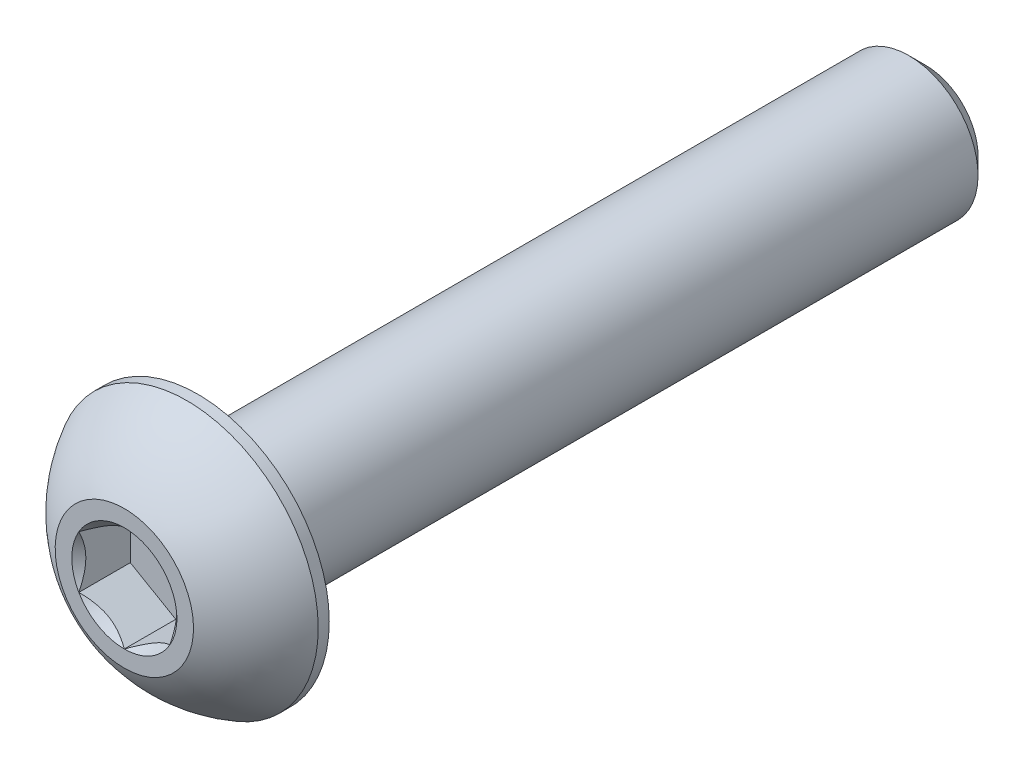
ISO-10303-21;
HEADER;
FILE_DESCRIPTION(('STEP AP214'),'2;1');
FILE_NAME('part.step','',(''),(''),'','','');
FILE_SCHEMA(('AUTOMOTIVE_DESIGN { 1 0 10303 214 1 1 1 1 }'));
ENDSEC;
DATA;
#1=APPLICATION_CONTEXT('core data for automotive mechanical design processes');
#2=APPLICATION_PROTOCOL_DEFINITION('international standard','automotive_design',2000,#1);
#3=PRODUCT_CONTEXT('',#1,'mechanical');
#4=PRODUCT('Part','Part','',(#3));
#5=PRODUCT_RELATED_PRODUCT_CATEGORY('part','',(#4));
#6=PRODUCT_DEFINITION_FORMATION('','',#4);
#7=PRODUCT_DEFINITION_CONTEXT('part definition',#1,'design');
#8=PRODUCT_DEFINITION('design','',#6,#7);
#9=PRODUCT_DEFINITION_SHAPE('','',#8);
#10=(LENGTH_UNIT() NAMED_UNIT(*) SI_UNIT(.MILLI.,.METRE.));
#11=(NAMED_UNIT(*) PLANE_ANGLE_UNIT() SI_UNIT($,.RADIAN.));
#12=(NAMED_UNIT(*) SI_UNIT($,.STERADIAN.) SOLID_ANGLE_UNIT());
#13=UNCERTAINTY_MEASURE_WITH_UNIT(LENGTH_MEASURE(1.E-05),#10,'distance_accuracy_value','');
#14=(GEOMETRIC_REPRESENTATION_CONTEXT(3) GLOBAL_UNCERTAINTY_ASSIGNED_CONTEXT((#13)) GLOBAL_UNIT_ASSIGNED_CONTEXT((#10,
#11,#12)) REPRESENTATION_CONTEXT('',''));
#15=CARTESIAN_POINT('',(0.,0.,0.));
#16=DIRECTION('',(0.,0.,1.));
#17=DIRECTION('',(1.,0.,0.));
#18=AXIS2_PLACEMENT_3D('',#15,#16,#17);
#19=CARTESIAN_POINT('',(0.,-2.41300000000001,-27.9654));
#20=DIRECTION('',(0.,0.,-1.));
#21=DIRECTION('',(0.,1.,0.));
#22=AXIS2_PLACEMENT_3D('',#19,#20,#21);
#23=PLANE('',#22);
#24=CARTESIAN_POINT('',(0.,0.,-27.9654));
#25=DIRECTION('',(0.,0.,-1.));
#26=DIRECTION('',(0.,1.,0.));
#27=AXIS2_PLACEMENT_3D('',#24,#25,#26);
#28=CIRCLE('',#27,1.81768750000001);
#29=CARTESIAN_POINT('',(0.,1.8176875,-27.9654));
#30=VERTEX_POINT('',#29);
#31=EDGE_CURVE('E42',#30,#30,#28,.T.);
#32=ORIENTED_EDGE('',*,*,#31,.T.);
#33=EDGE_LOOP('',(#32));
#34=FACE_BOUND('',#33,.T.);
#35=ADVANCED_FACE('F34',(#34),#23,.T.);
#36=CARTESIAN_POINT('',(0.,0.,-27.9654));
#37=DIRECTION('',(0.,0.,-1.));
#38=DIRECTION('',(0.,1.,0.));
#39=AXIS2_PLACEMENT_3D('',#36,#37,#38);
#40=CYLINDRICAL_SURFACE('',#39,2.41300000000001);
#41=CARTESIAN_POINT('',(0.,0.,-27.3700875));
#42=DIRECTION('',(0.,0.,-1.));
#43=DIRECTION('',(0.,1.,0.));
#44=AXIS2_PLACEMENT_3D('',#41,#42,#43);
#45=CIRCLE('',#44,2.41300000000001);
#46=CARTESIAN_POINT('',(0.,2.41300000000001,-27.3700875));
#47=VERTEX_POINT('',#46);
#48=EDGE_CURVE('E11',#47,#47,#45,.F.);
#49=ORIENTED_EDGE('',*,*,#48,.T.);
#50=EDGE_LOOP('',(#49));
#51=FACE_BOUND('',#50,.T.);
#52=CARTESIAN_POINT('',(0.,0.,-2.5654));
#53=DIRECTION('',(0.,0.,1.));
#54=DIRECTION('',(1.,0.,0.));
#55=AXIS2_PLACEMENT_3D('',#52,#53,#54);
#56=CIRCLE('',#55,2.41300000000001);
#57=CARTESIAN_POINT('',(2.41300000000001,0.,-2.5654));
#58=VERTEX_POINT('',#57);
#59=EDGE_CURVE('E168',#58,#58,#56,.F.);
#60=ORIENTED_EDGE('',*,*,#59,.T.);
#61=EDGE_LOOP('',(#60));
#62=FACE_BOUND('',#61,.T.);
#63=ADVANCED_FACE('F176',(#51,#62),#40,.T.);
#64=CARTESIAN_POINT('',(0.,0.,-27.9654));
#65=DIRECTION('',(0.,0.,1.));
#66=DIRECTION('',(0.,-1.,0.));
#67=AXIS2_PLACEMENT_3D('',#64,#65,#66);
#68=CONICAL_SURFACE('',#67,1.81768750000001,0.785398163397447);
#69=ORIENTED_EDGE('',*,*,#48,.F.);
#70=EDGE_LOOP('',(#69));
#71=FACE_BOUND('',#70,.T.);
#72=ORIENTED_EDGE('',*,*,#31,.F.);
#73=EDGE_LOOP('',(#72));
#74=FACE_BOUND('',#73,.T.);
#75=ADVANCED_FACE('F36',(#71,#74),#68,.T.);
#76=CARTESIAN_POINT('',(0.,0.,-4.5748806144438));
#77=DIRECTION('',(0.,0.,1.));
#78=DIRECTION('',(0.,-1.,0.));
#79=AXIS2_PLACEMENT_3D('',#76,#77,#78);
#80=SPHERICAL_SURFACE('',#79,5.17224338526463);
#81=CARTESIAN_POINT('',(0.,0.,0.));
#82=DIRECTION('',(0.,0.,1.));
#83=DIRECTION('',(1.,0.,0.));
#84=AXIS2_PLACEMENT_3D('',#81,#82,#83);
#85=CIRCLE('',#84,2.41300000000001);
#86=CARTESIAN_POINT('',(0.,-2.41300000000001,0.));
#87=VERTEX_POINT('',#86);
#88=EDGE_CURVE('E165',#87,#87,#85,.T.);
#89=CARTESIAN_POINT('',(0.,0.,-2.18059));
#90=DIRECTION('',(0.,0.,1.));
#91=DIRECTION('',(1.,0.,0.));
#92=AXIS2_PLACEMENT_3D('',#89,#90,#91);
#93=CIRCLE('',#92,4.5847);
#94=CARTESIAN_POINT('',(0.,-4.5847,-2.18059));
#95=VERTEX_POINT('',#94);
#96=EDGE_CURVE('E159',#95,#95,#93,.T.);
#97=CARTESIAN_POINT('',(0.,-2.41300000000001,0.));
#98=CARTESIAN_POINT('',(0.,-2.44179113663083,-0.0151857097788009));
#99=CARTESIAN_POINT('',(0.,-2.47043888331474,-0.0306432741933343));
#100=CARTESIAN_POINT('',(0.,-2.52743746903511,-0.0620964513369402));
#101=CARTESIAN_POINT('',(0.,-2.55578830807155,-0.0780920640660128));
#102=CARTESIAN_POINT('',(0.,-2.61218295074331,-0.110615676881771));
#103=CARTESIAN_POINT('',(0.,-2.64022675437863,-0.127143676968457));
#104=CARTESIAN_POINT('',(0.,-2.69599733629138,-0.160726162390165));
#105=CARTESIAN_POINT('',(0.,-2.72372411456883,-0.177780647725188));
#106=CARTESIAN_POINT('',(0.,-2.77885076121155,-0.21241002764294));
#107=CARTESIAN_POINT('',(0.,-2.80625062957682,-0.229984922225668));
#108=CARTESIAN_POINT('',(0.,-2.86071369040082,-0.265648855453746));
#109=CARTESIAN_POINT('',(0.,-2.88777688285954,-0.283737894099096));
#110=CARTESIAN_POINT('',(0.,-2.94155694533546,-0.320423667994127));
#111=CARTESIAN_POINT('',(0.,-2.96827381535266,-0.339020403243808));
#112=CARTESIAN_POINT('',(0.,-3.02135171000009,-0.37671494166065));
#113=CARTESIAN_POINT('',(0.,-3.04771273463033,-0.39581274482781));
#114=CARTESIAN_POINT('',(0.,-3.10006954235699,-0.434502611862808));
#115=CARTESIAN_POINT('',(0.,-3.12606532545341,-0.454094675730644));
#116=CARTESIAN_POINT('',(0.,-3.17768238416296,-0.493766080756604));
#117=CARTESIAN_POINT('',(0.,-3.20330365977609,-0.513845421914727));
#118=CARTESIAN_POINT('',(0.,-3.25416257105645,-0.554484224430573));
#119=CARTESIAN_POINT('',(0.,-3.27940020672367,-0.575043685788296));
#120=CARTESIAN_POINT('',(0.,-3.32948284239517,-0.616635400476974));
#121=CARTESIAN_POINT('',(0.,-3.35432784239946,-0.637667653807929));
#122=CARTESIAN_POINT('',(0.,-3.40361635097913,-0.680197455694828));
#123=CARTESIAN_POINT('',(0.,-3.42805985955453,-0.701695004250773));
#124=CARTESIAN_POINT('',(0.,-3.47653667261836,-0.745147733989217));
#125=CARTESIAN_POINT('',(0.,-3.5005699771068,-0.767102915171717));
#126=CARTESIAN_POINT('',(0.,-3.54821781555203,-0.81146308444603));
#127=CARTESIAN_POINT('',(0.,-3.57183234950881,-0.833868072537843));
#128=CARTESIAN_POINT('',(0.,-3.61863422971284,-0.879119869584106));
#129=CARTESIAN_POINT('',(0.,-3.64182157596008,-0.901966678538555));
#130=CARTESIAN_POINT('',(0.,-3.68776081583415,-0.948093973780533));
#131=CARTESIAN_POINT('',(0.,-3.71051270946098,-0.971374460068061));
#132=CARTESIAN_POINT('',(0.,-3.75557293439636,-1.01836081186645));
#133=CARTESIAN_POINT('',(0.,-3.7778812657049,-1.0420666773773));
#134=CARTESIAN_POINT('',(0.,-3.82204641440941,-1.08989533789018));
#135=CARTESIAN_POINT('',(0.,-3.84390323180538,-1.11401813289221));
#136=CARTESIAN_POINT('',(0.,-3.88715756202836,-1.16267205404467));
#137=CARTESIAN_POINT('',(0.,-3.90855507485536,-1.18720318019511));
#138=CARTESIAN_POINT('',(0.,-3.95088316899876,-1.23666501975588));
#139=CARTESIAN_POINT('',(0.,-3.97181375031515,-1.26159573316622));
#140=CARTESIAN_POINT('',(0.,-4.01320052092911,-1.31184786092909));
#141=CARTESIAN_POINT('',(0.,-4.03365671022669,-1.33716927528163));
#142=CARTESIAN_POINT('',(0.,-4.07408740538699,-1.38819377934977));
#143=CARTESIAN_POINT('',(0.,-4.09406191124973,-1.41389686906536));
#144=CARTESIAN_POINT('',(0.,-4.13352211981722,-1.46567556223513));
#145=CARTESIAN_POINT('',(0.,-4.15300782252198,-1.4917511656893));
#146=CARTESIAN_POINT('',(0.,-4.19148347927457,-1.54426559193551));
#147=CARTESIAN_POINT('',(0.,-4.2104734333224,-1.57070441472756));
#148=CARTESIAN_POINT('',(0.,-4.24795082398615,-1.6239358557723));
#149=CARTESIAN_POINT('',(0.,-4.26643826060207,-1.65072847402499));
#150=CARTESIAN_POINT('',(0.,-4.3029040266735,-1.70465795604563));
#151=CARTESIAN_POINT('',(0.,-4.32088235612901,-1.73179481981358));
#152=CARTESIAN_POINT('',(0.,-4.35632349988304,-1.78640312007115));
#153=CARTESIAN_POINT('',(0.,-4.37378631418156,-1.81387455656079));
#154=CARTESIAN_POINT('',(0.,-4.40819020238473,-1.86914221075438));
#155=CARTESIAN_POINT('',(0.,-4.42513127628939,-1.89693842845834));
#156=CARTESIAN_POINT('',(0.,-4.45848564813517,-1.95284573578717));
#157=CARTESIAN_POINT('',(0.,-4.4748989460763,-1.98095682541204));
#158=CARTESIAN_POINT('',(0.,-4.50719190474587,-2.03748386259806));
#159=CARTESIAN_POINT('',(0.,-4.5230715654743,-2.06589981015923));
#160=CARTESIAN_POINT('',(0.,-4.55429163018258,-2.12302641242262));
#161=CARTESIAN_POINT('',(0.,-4.56963203416241,-2.15173706712485));
#162=CARTESIAN_POINT('',(0.,-4.5847,-2.18059));
#163=B_SPLINE_CURVE_WITH_KNOTS('',3,(#97,#98,#99,#100,#101,#102,#103,#104,#105,#106,#107,#108,
#109,#110,#111,#112,#113,#114,#115,#116,#117,#118,#119,#120,#121,#122,#123,#124,#125,#126,#127,
#128,#129,#130,#131,#132,#133,#134,#135,#136,#137,#138,#139,#140,#141,#142,#143,#144,#145,#146,
#147,#148,#149,#150,#151,#152,#153,#154,#155,#156,#157,#158,#159,#160,#161,#162),.UNSPECIFIED.,
.F.,.F.,(4,2,2,2,2,2,2,2,2,2,2,2,2,2,2,2,2,2,2,2,2,2,2,2,2,2,2,2,2,2,2,2,4),(0.,
0.0976500604051489,0.195300120810298,0.292950181215447,0.390600241620597,0.488250302025746,
0.585900362430895,0.683550422836045,0.781200483241194,0.878850543646343,0.976500604051493,
1.07415066445664,1.17180072486179,1.26945078526694,1.36710084567209,1.46475090607724,
1.56240096648239,1.66005102688754,1.75770108729269,1.85535114769784,1.95300120810299,
2.05065126850813,2.14830132891328,2.24595138931843,2.34360144972358,2.44125151012873,
2.53890157053388,2.63655163093903,2.73420169134418,2.83185175174933,2.92950181215448,
3.02715187255963,3.12480193296478),.UNSPECIFIED.);
#164=EDGE_CURVE('BSEAM175',#87,#95,#163,.T.);
#165=ORIENTED_EDGE('',*,*,#88,.F.);
#166=ORIENTED_EDGE('',*,*,#96,.T.);
#167=ORIENTED_EDGE('',*,*,#164,.T.);
#168=ORIENTED_EDGE('',*,*,#164,.F.);
#169=EDGE_LOOP('',(#165,#167,#166,#168));
#170=FACE_BOUND('',#169,.T.);
#171=ADVANCED_FACE('F175',(#170),#80,.T.);
#172=CARTESIAN_POINT('',(0.,-2.41300000000001,0.));
#173=DIRECTION('',(0.,0.,-1.));
#174=DIRECTION('',(-1.,0.,0.));
#175=AXIS2_PLACEMENT_3D('',#172,#173,#174);
#176=PLANE('',#175);
#177=CARTESIAN_POINT('',(0.,0.,0.));
#178=DIRECTION('',(0.,0.,1.));
#179=DIRECTION('',(1.,0.,0.));
#180=AXIS2_PLACEMENT_3D('',#177,#178,#179);
#181=CIRCLE('',#180,1.83308710467706);
#182=CARTESIAN_POINT('',(-1.5875,0.91654355233853,0.));
#183=VERTEX_POINT('',#182);
#184=CARTESIAN_POINT('',(-1.5875,-0.916543552338531,0.));
#185=VERTEX_POINT('',#184);
#186=EDGE_CURVE('E55',#183,#185,#181,.T.);
#187=ORIENTED_EDGE('',*,*,#186,.F.);
#188=CARTESIAN_POINT('',(0.,1.83308710467706,0.));
#189=VERTEX_POINT('',#188);
#190=EDGE_CURVE('E129',#189,#183,#181,.T.);
#191=ORIENTED_EDGE('',*,*,#190,.F.);
#192=CARTESIAN_POINT('',(1.5875,0.91654355233853,0.));
#193=VERTEX_POINT('',#192);
#194=EDGE_CURVE('E106',#193,#189,#181,.T.);
#195=ORIENTED_EDGE('',*,*,#194,.F.);
#196=CARTESIAN_POINT('',(1.5875,-0.91654355233853,0.));
#197=VERTEX_POINT('',#196);
#198=EDGE_CURVE('E95',#197,#193,#181,.T.);
#199=ORIENTED_EDGE('',*,*,#198,.F.);
#200=CARTESIAN_POINT('',(0.,-1.83308710467706,0.));
#201=VERTEX_POINT('',#200);
#202=EDGE_CURVE('E87',#201,#197,#181,.T.);
#203=ORIENTED_EDGE('',*,*,#202,.F.);
#204=EDGE_CURVE('E48',#185,#201,#181,.T.);
#205=ORIENTED_EDGE('',*,*,#204,.F.);
#206=EDGE_LOOP('',(#187,#191,#195,#199,#203,#205));
#207=FACE_BOUND('',#206,.T.);
#208=ORIENTED_EDGE('',*,*,#88,.T.);
#209=EDGE_LOOP('',(#208));
#210=FACE_BOUND('',#209,.T.);
#211=ADVANCED_FACE('F126',(#207,#210),#176,.F.);
#212=CARTESIAN_POINT('',(0.,-4.5847,-2.5654));
#213=DIRECTION('',(0.,0.,1.));
#214=DIRECTION('',(1.,0.,0.));
#215=AXIS2_PLACEMENT_3D('',#212,#213,#214);
#216=PLANE('',#215);
#217=ORIENTED_EDGE('',*,*,#59,.F.);
#218=EDGE_LOOP('',(#217));
#219=FACE_BOUND('',#218,.T.);
#220=CARTESIAN_POINT('',(0.,0.,-2.5654));
#221=DIRECTION('',(0.,0.,1.));
#222=DIRECTION('',(1.,0.,0.));
#223=AXIS2_PLACEMENT_3D('',#220,#221,#222);
#224=CIRCLE('',#223,4.5847);
#225=CARTESIAN_POINT('',(4.5847,0.,-2.5654));
#226=VERTEX_POINT('',#225);
#227=EDGE_CURVE('E162',#226,#226,#224,.T.);
#228=ORIENTED_EDGE('',*,*,#227,.F.);
#229=EDGE_LOOP('',(#228));
#230=FACE_BOUND('',#229,.T.);
#231=ADVANCED_FACE('F193',(#219,#230),#216,.F.);
#232=CARTESIAN_POINT('',(0.,0.,0.));
#233=DIRECTION('',(0.,0.,1.));
#234=DIRECTION('',(1.,0.,0.));
#235=AXIS2_PLACEMENT_3D('',#232,#233,#234);
#236=CYLINDRICAL_SURFACE('',#235,4.5847);
#237=ORIENTED_EDGE('',*,*,#96,.F.);
#238=EDGE_LOOP('',(#237));
#239=FACE_BOUND('',#238,.T.);
#240=ORIENTED_EDGE('',*,*,#227,.T.);
#241=EDGE_LOOP('',(#240));
#242=FACE_BOUND('',#241,.T.);
#243=ADVANCED_FACE('F196',(#239,#242),#236,.T.);
#244=CARTESIAN_POINT('',(0.,0.,0.));
#245=DIRECTION('',(0.,0.,1.));
#246=DIRECTION('',(1.,0.,0.));
#247=AXIS2_PLACEMENT_3D('',#244,#245,#246);
#248=CONICAL_SURFACE('',#247,1.83308710467706,0.78539816339745);
#249=ORIENTED_EDGE('',*,*,#198,.T.);
#250=CARTESIAN_POINT('',(1.5875,-1.83163614255911,0.59076256242872));
#251=CARTESIAN_POINT('',(1.5875,-1.78705354867301,0.557077854970687));
#252=CARTESIAN_POINT('',(1.5875,-1.74222294172304,0.523722330129374));
#253=CARTESIAN_POINT('',(1.5875,-1.65196486804948,0.457805676035674));
#254=CARTESIAN_POINT('',(1.5875,-1.60653725469452,0.425244747775196));
#255=CARTESIAN_POINT('',(1.5875,-1.46854281957862,0.328493449581856));
#256=CARTESIAN_POINT('',(1.5875,-1.374942116398,0.26575326472013));
#257=CARTESIAN_POINT('',(1.5875,-1.17864136279131,0.142553151374455));
#258=CARTESIAN_POINT('',(1.5875,-1.07572731608201,0.082430328988448));
#259=CARTESIAN_POINT('',(1.5875,-0.864754189642491,-0.0275706334091861));
#260=CARTESIAN_POINT('',(1.5875,-0.756714033368241,-0.0774833149098327));
#261=CARTESIAN_POINT('',(1.5875,-0.594580029742254,-0.138547963732225));
#262=CARTESIAN_POINT('',(1.5875,-0.542894373992029,-0.156067797483246));
#263=CARTESIAN_POINT('',(1.5875,-0.43827206298796,-0.186958420138029));
#264=CARTESIAN_POINT('',(1.5875,-0.385335322129527,-0.200328924237228));
#265=CARTESIAN_POINT('',(1.5875,-0.27941340082176,-0.222002681029222));
#266=CARTESIAN_POINT('',(1.5875,-0.226446313997132,-0.23039297678682));
#267=CARTESIAN_POINT('',(1.5875,-0.119941637696217,-0.241941911004304));
#268=CARTESIAN_POINT('',(1.5875,-0.0664041487354877,-0.245101456361822));
#269=CARTESIAN_POINT('',(1.5875,0.0387581191230252,-0.245952982967873));
#270=CARTESIAN_POINT('',(1.5875,0.0903813814307128,-0.243840334615407));
#271=CARTESIAN_POINT('',(1.5875,0.193187301884777,-0.2346958466939));
#272=CARTESIAN_POINT('',(1.5875,0.244369916852416,-0.227663530480822));
#273=CARTESIAN_POINT('',(1.5875,0.346790527644864,-0.208944949385831));
#274=CARTESIAN_POINT('',(1.5875,0.398013804024116,-0.197179358676918));
#275=CARTESIAN_POINT('',(1.5875,0.499340680151772,-0.169620657195823));
#276=CARTESIAN_POINT('',(1.5875,0.549444371946839,-0.153827878853827));
#277=CARTESIAN_POINT('',(1.5875,0.707022639392758,-0.098213379149143));
#278=CARTESIAN_POINT('',(1.5875,0.812258737347618,-0.0520647673661017));
#279=CARTESIAN_POINT('',(1.5875,1.01778868985768,0.050545840230815));
#280=CARTESIAN_POINT('',(1.5875,1.11806310902619,0.107044854931528));
#281=CARTESIAN_POINT('',(1.5875,1.30970442541657,0.223612502746909));
#282=CARTESIAN_POINT('',(1.5875,1.40126637111622,0.283364441729407));
#283=CARTESIAN_POINT('',(1.5875,1.53616443032973,0.375737008407379));
#284=CARTESIAN_POINT('',(1.5875,1.58054835781601,0.406854013978782));
#285=CARTESIAN_POINT('',(1.5875,1.66870952468079,0.469911549862003));
#286=CARTESIAN_POINT('',(1.5875,1.71248692756594,0.501851851316698));
#287=CARTESIAN_POINT('',(1.5875,1.75601179194806,0.53413355750478));
#288=B_SPLINE_CURVE_WITH_KNOTS('',3,(#250,#251,#252,#253,#254,#255,#256,#257,#258,#259,#260,
#261,#262,#263,#264,#265,#266,#267,#268,#269,#270,#271,#272,#273,#274,#275,#276,#277,#278,#279,
#280,#281,#282,#283,#284,#285,#286,#287),.UNSPECIFIED.,.F.,.F.,(4,2,2,2,2,2,2,2,2,2,2,2,2,2,2,2,
2,2,4),(0.,0.167627505155179,0.335296980901749,0.673194674814517,1.03047007104644,
1.38651603103036,1.55010049322983,1.71369618117078,1.87434127486521,2.03495851329853,
2.18971280500511,2.34448209222147,2.50196108398249,2.65942708061187,3.00314617712053,
3.3481194986366,3.67595792150357,3.83856722061512,4.00113179547715),.UNSPECIFIED.);
#289=EDGE_CURVE('E100',#197,#193,#288,.T.);
#290=ORIENTED_EDGE('',*,*,#289,.F.);
#291=EDGE_LOOP('',(#249,#290));
#292=FACE_BOUND('',#291,.T.);
#293=ADVANCED_FACE('F101',(#292),#248,.F.);
#294=ORIENTED_EDGE('',*,*,#194,.T.);
#295=CARTESIAN_POINT('',(1.5877,0.916428082284693,0.000115480963707398));
#296=CARTESIAN_POINT('',(1.53312479190086,0.94793709337181,-0.0313691916294023));
#297=CARTESIAN_POINT('',(1.47763696320971,0.979973006203395,-0.0610049539864692));
#298=CARTESIAN_POINT('',(1.36449087915364,1.04529792829092,-0.115267739979174));
#299=CARTESIAN_POINT('',(1.30682185887062,1.07859315267522,-0.139864564866823));
#300=CARTESIAN_POINT('',(1.1905349781269,1.14573141457583,-0.181999635727418));
#301=CARTESIAN_POINT('',(1.13194674474407,1.17955734689075,-0.199643807270177));
#302=CARTESIAN_POINT('',(1.01348022674557,1.24795402294714,-0.22682852991503));
#303=CARTESIAN_POINT('',(0.953605562983895,1.28252267618759,-0.236389379304922));
#304=CARTESIAN_POINT('',(0.850418771876557,1.34209759781022,-0.245015586895991));
#305=CARTESIAN_POINT('',(0.807240015952287,1.36702686416637,-0.246292807190423));
#306=CARTESIAN_POINT('',(0.720953038535398,1.41684467380557,-0.244142944185295));
#307=CARTESIAN_POINT('',(0.677844847078612,1.44173319974742,-0.240714211450656));
#308=CARTESIAN_POINT('',(0.59204633500203,1.49126899379091,-0.229349005566656));
#309=CARTESIAN_POINT('',(0.549356408925406,1.51591603410293,-0.221408628198357));
#310=CARTESIAN_POINT('',(0.464693063478359,1.56479643938728,-0.201451585548897));
#311=CARTESIAN_POINT('',(0.422719959755075,1.58902962212064,-0.189433170791308));
#312=CARTESIAN_POINT('',(0.315211458113566,1.65109968448354,-0.153753102752753));
#313=CARTESIAN_POINT('',(0.2503427717089,1.68855163804125,-0.127401427696863));
#314=CARTESIAN_POINT('',(0.154961599380924,1.74361998356043,-0.0829164631482974));
#315=CARTESIAN_POINT('',(0.123530699536157,1.76176662204668,-0.0672871421988681));
#316=CARTESIAN_POINT('',(0.0612469855696375,1.79772614107138,-0.0346015121388982));
#317=CARTESIAN_POINT('',(0.0303939039605771,1.8155391760437,-0.0175458843430298));
#318=CARTESIAN_POINT('',(-0.000199999999999502,1.8332025747309,0.000115480963706989));
#319=B_SPLINE_CURVE_WITH_KNOTS('',3,(#295,#296,#297,#298,#299,#300,#301,#302,#303,#304,#305,
#306,#307,#308,#309,#310,#311,#312,#313,#314,#315,#316,#317,#318),.UNSPECIFIED.,.F.,.F.,(4,2,2,
2,2,2,2,2,2,2,2,4),(0.,0.211482650810816,0.424197870807276,0.633533884524815,0.842342653263348,
0.991755553727141,1.14122083674204,1.29081565918877,1.44047473906438,1.6781878086972,
1.79671410024894,1.91518409436631),.UNSPECIFIED.);
#320=EDGE_CURVE('E105',#193,#189,#319,.T.);
#321=ORIENTED_EDGE('',*,*,#320,.F.);
#322=EDGE_LOOP('',(#294,#321));
#323=FACE_BOUND('',#322,.T.);
#324=ADVANCED_FACE('F287',(#323),#248,.F.);
#325=ORIENTED_EDGE('',*,*,#190,.T.);
#326=CARTESIAN_POINT('',(0.0002000000000005,1.8332025747309,0.000115480963707052));
#327=CARTESIAN_POINT('',(-0.0543752080991358,1.80169356364378,-0.031369191629403));
#328=CARTESIAN_POINT('',(-0.109863036790289,1.7696576508122,-0.06100495398647));
#329=CARTESIAN_POINT('',(-0.223009120846358,1.70433272872467,-0.115267739979175));
#330=CARTESIAN_POINT('',(-0.28067814112938,1.67103750434037,-0.139864564866824));
#331=CARTESIAN_POINT('',(-0.396965021873102,1.60389924243976,-0.181999635727418));
#332=CARTESIAN_POINT('',(-0.45555325525593,1.57007331012484,-0.199643807270178));
#333=CARTESIAN_POINT('',(-0.57401977325443,1.50167663406845,-0.226828529915031));
#334=CARTESIAN_POINT('',(-0.633894437016104,1.46710798082801,-0.236389379304923));
#335=CARTESIAN_POINT('',(-0.737081228123441,1.40753305920537,-0.245015586895992));
#336=CARTESIAN_POINT('',(-0.780259984047711,1.38260379284922,-0.246292807190424));
#337=CARTESIAN_POINT('',(-0.8665469614646,1.33278598321002,-0.244142944185296));
#338=CARTESIAN_POINT('',(-0.909655152921387,1.30789745726817,-0.240714211450657));
#339=CARTESIAN_POINT('',(-0.995453664997968,1.25836166322468,-0.229349005566657));
#340=CARTESIAN_POINT('',(-1.03814359107459,1.23371462291266,-0.221408628198359));
#341=CARTESIAN_POINT('',(-1.12280693652164,1.18483421762831,-0.201451585548899));
#342=CARTESIAN_POINT('',(-1.16478004024492,1.16060103489495,-0.18943317079131));
#343=CARTESIAN_POINT('',(-1.27228854188643,1.09853097253205,-0.153753102752754));
#344=CARTESIAN_POINT('',(-1.3371572282911,1.06107901897434,-0.127401427696864));
#345=CARTESIAN_POINT('',(-1.43253840061907,1.00601067345516,-0.0829164631482981));
#346=CARTESIAN_POINT('',(-1.46396930046384,0.987864034968913,-0.0672871421988687));
#347=CARTESIAN_POINT('',(-1.52625301443036,0.951904515944213,-0.0346015121388987));
#348=CARTESIAN_POINT('',(-1.55710609603942,0.934091480971892,-0.0175458843430301));
#349=CARTESIAN_POINT('',(-1.5877,0.916428082284692,0.000115480963706581));
#350=B_SPLINE_CURVE_WITH_KNOTS('',3,(#326,#327,#328,#329,#330,#331,#332,#333,#334,#335,#336,
#337,#338,#339,#340,#341,#342,#343,#344,#345,#346,#347,#348,#349),.UNSPECIFIED.,.F.,.F.,(4,2,2,
2,2,2,2,2,2,2,2,4),(0.,0.211482650810816,0.424197870807275,0.633533884524815,0.842342653263348,
0.991755553727141,1.14122083674204,1.29081565918877,1.44047473906437,1.6781878086972,
1.79671410024894,1.91518409436631),.UNSPECIFIED.);
#351=EDGE_CURVE('E136',#189,#183,#350,.T.);
#352=ORIENTED_EDGE('',*,*,#351,.F.);
#353=EDGE_LOOP('',(#325,#352));
#354=FACE_BOUND('',#353,.T.);
#355=ADVANCED_FACE('F134',(#354),#248,.F.);
#356=ORIENTED_EDGE('',*,*,#186,.T.);
#357=CARTESIAN_POINT('',(-1.5875,-1.83163614232865,0.590762562254564));
#358=CARTESIAN_POINT('',(-1.5875,-1.78705354844902,0.55707785480324));
#359=CARTESIAN_POINT('',(-1.5875,-1.74222294150555,0.523722329968627));
#360=CARTESIAN_POINT('',(-1.5875,-1.65196486784504,0.457805675888286));
#361=CARTESIAN_POINT('',(-1.5875,-1.60653725449665,0.425244747634468));
#362=CARTESIAN_POINT('',(-1.5875,-1.46854281940082,0.328493449461236));
#363=CARTESIAN_POINT('',(-1.5875,-1.37494211623386,0.265753264612858));
#364=CARTESIAN_POINT('',(-1.5875,-1.17864136265695,0.142553151294644));
#365=CARTESIAN_POINT('',(-1.5875,-1.07572731596385,0.0824303289226488));
#366=CARTESIAN_POINT('',(-1.5875,-0.864754189558117,-0.0275706334490078));
#367=CARTESIAN_POINT('',(-1.5875,-0.756714033301438,-0.0774833149376714));
#368=CARTESIAN_POINT('',(-1.5875,-0.594580029688666,-0.138547963751185));
#369=CARTESIAN_POINT('',(-1.5875,-0.542894373932898,-0.156067797502568));
#370=CARTESIAN_POINT('',(-1.5875,-0.438272062917561,-0.186958420156953));
#371=CARTESIAN_POINT('',(-1.5875,-0.3853353220534,-0.200328924255393));
#372=CARTESIAN_POINT('',(-1.5875,-0.27941340073437,-0.222002681044567));
#373=CARTESIAN_POINT('',(-1.5875,-0.226446313904207,-0.230392976800141));
#374=CARTESIAN_POINT('',(-1.5875,-0.119941637592405,-0.241941911012322));
#375=CARTESIAN_POINT('',(-1.5875,-0.066404148626324,-0.245101456366562));
#376=CARTESIAN_POINT('',(-1.5875,0.0387581192420272,-0.245952982965122));
#377=CARTESIAN_POINT('',(-1.5875,0.0903813815542153,-0.243840334608509));
#378=CARTESIAN_POINT('',(-1.5875,0.193187302016829,-0.234695846678065));
#379=CARTESIAN_POINT('',(-1.5875,0.244369916988516,-0.227663530460197));
#380=CARTESIAN_POINT('',(-1.5875,0.346790527788955,-0.208944949355169));
#381=CARTESIAN_POINT('',(-1.5875,0.398013804172138,-0.197179358640977));
#382=CARTESIAN_POINT('',(-1.5875,0.499340680307276,-0.169620657149213));
#383=CARTESIAN_POINT('',(-1.5875,0.549444372105893,-0.153827878801824));
#384=CARTESIAN_POINT('',(-1.5875,0.707022639586407,-0.0982133790717419));
#385=CARTESIAN_POINT('',(-1.5875,0.812258737570577,-0.0520647672653367));
#386=CARTESIAN_POINT('',(-1.5875,1.01778869013701,0.0505458403808824));
#387=CARTESIAN_POINT('',(-1.5875,1.11806310933256,0.107044855107552));
#388=CARTESIAN_POINT('',(-1.5875,1.30970442577157,0.223612502972616));
#389=CARTESIAN_POINT('',(-1.5875,1.40126637149297,0.283364441978612));
#390=CARTESIAN_POINT('',(-1.5875,1.53616443073864,0.37573700869171));
#391=CARTESIAN_POINT('',(-1.5875,1.58054835823549,0.406854014274728));
#392=CARTESIAN_POINT('',(-1.5875,1.66870952512132,0.469911550181166));
#393=CARTESIAN_POINT('',(-1.5875,1.71248692801697,0.501851851647461));
#394=CARTESIAN_POINT('',(-1.5875,1.75601179240957,0.534133557847131));
#395=B_SPLINE_CURVE_WITH_KNOTS('',3,(#357,#358,#359,#360,#361,#362,#363,#364,#365,#366,#367,
#368,#369,#370,#371,#372,#373,#374,#375,#376,#377,#378,#379,#380,#381,#382,#383,#384,#385,#386,
#387,#388,#389,#390,#391,#392,#393,#394),.UNSPECIFIED.,.F.,.F.,(4,2,2,2,2,2,2,2,2,2,2,2,2,2,2,2,
2,2,4),(0.,0.167627505127548,0.335296980846479,0.673194674702938,1.0304700708717,
1.38651603079307,1.55010049300858,1.71369618096554,1.87434127467533,2.034958513124,
2.18971280484453,2.34448209207484,2.50196108385089,2.65942708049529,3.00314617711216,
3.34811949873714,3.67595792169729,3.83856722085481,4.00113179576279),.UNSPECIFIED.);
#396=EDGE_CURVE('E140',#183,#185,#395,.F.);
#397=ORIENTED_EDGE('',*,*,#396,.F.);
#398=EDGE_LOOP('',(#356,#397));
#399=FACE_BOUND('',#398,.T.);
#400=ADVANCED_FACE('F281',(#399),#248,.F.);
#401=ORIENTED_EDGE('',*,*,#204,.T.);
#402=CARTESIAN_POINT('',(-1.5877,-0.916428082284693,0.000115480963706964));
#403=CARTESIAN_POINT('',(-1.53312479190086,-0.94793709337181,-0.0313691916294027));
#404=CARTESIAN_POINT('',(-1.47763696320971,-0.979973006203395,-0.0610049539864696));
#405=CARTESIAN_POINT('',(-1.36449087915364,-1.04529792829092,-0.115267739979174));
#406=CARTESIAN_POINT('',(-1.30682185887062,-1.07859315267522,-0.139864564866823));
#407=CARTESIAN_POINT('',(-1.1905349781269,-1.14573141457583,-0.181999635727418));
#408=CARTESIAN_POINT('',(-1.13194674474407,-1.17955734689075,-0.199643807270177));
#409=CARTESIAN_POINT('',(-1.01348022674557,-1.24795402294714,-0.22682852991503));
#410=CARTESIAN_POINT('',(-0.953605562983895,-1.28252267618759,-0.236389379304922));
#411=CARTESIAN_POINT('',(-0.850418771876557,-1.34209759781022,-0.245015586895991));
#412=CARTESIAN_POINT('',(-0.807240015952288,-1.36702686416637,-0.246292807190423));
#413=CARTESIAN_POINT('',(-0.720953038535399,-1.41684467380557,-0.244142944185295));
#414=CARTESIAN_POINT('',(-0.677844847078612,-1.44173319974742,-0.240714211450656));
#415=CARTESIAN_POINT('',(-0.592046335002031,-1.49126899379091,-0.229349005566656));
#416=CARTESIAN_POINT('',(-0.549356408925406,-1.51591603410293,-0.221408628198358));
#417=CARTESIAN_POINT('',(-0.464693063478358,-1.56479643938728,-0.201451585548898));
#418=CARTESIAN_POINT('',(-0.422719959755074,-1.58902962212064,-0.189433170791308));
#419=CARTESIAN_POINT('',(-0.315211458113567,-1.65109968448354,-0.153753102752753));
#420=CARTESIAN_POINT('',(-0.250342771708901,-1.68855163804125,-0.127401427696863));
#421=CARTESIAN_POINT('',(-0.154961599380925,-1.74361998356043,-0.0829164631482977));
#422=CARTESIAN_POINT('',(-0.123530699536158,-1.76176662204668,-0.0672871421988683));
#423=CARTESIAN_POINT('',(-0.0612469855696388,-1.79772614107138,-0.0346015121388984));
#424=CARTESIAN_POINT('',(-0.0303939039605786,-1.8155391760437,-0.01754588434303));
#425=CARTESIAN_POINT('',(0.00019999999999815,-1.8332025747309,0.000115480963706472));
#426=B_SPLINE_CURVE_WITH_KNOTS('',3,(#402,#403,#404,#405,#406,#407,#408,#409,#410,#411,#412,
#413,#414,#415,#416,#417,#418,#419,#420,#421,#422,#423,#424,#425),.UNSPECIFIED.,.F.,.F.,(4,2,2,
2,2,2,2,2,2,2,2,4),(0.,0.211482650810816,0.424197870807275,0.633533884524815,0.842342653263347,
0.99175555372714,1.14122083674204,1.29081565918877,1.44047473906437,1.6781878086972,
1.79671410024894,1.91518409436631),.UNSPECIFIED.);
#427=EDGE_CURVE('E116',#185,#201,#426,.T.);
#428=ORIENTED_EDGE('',*,*,#427,.F.);
#429=EDGE_LOOP('',(#401,#428));
#430=FACE_BOUND('',#429,.T.);
#431=ADVANCED_FACE('F225',(#430),#248,.F.);
#432=ORIENTED_EDGE('',*,*,#202,.T.);
#433=CARTESIAN_POINT('',(-0.000200000000001735,-1.8332025747309,0.000115480963706401));
#434=CARTESIAN_POINT('',(0.0543752080991348,-1.80169356364378,-0.0313691916294034));
#435=CARTESIAN_POINT('',(0.109863036790288,-1.7696576508122,-0.0610049539864704));
#436=CARTESIAN_POINT('',(0.223009120846357,-1.70433272872467,-0.115267739979175));
#437=CARTESIAN_POINT('',(0.280678141129379,-1.67103750434037,-0.139864564866824));
#438=CARTESIAN_POINT('',(0.396965021873101,-1.60389924243976,-0.181999635727419));
#439=CARTESIAN_POINT('',(0.455553255255929,-1.57007331012484,-0.199643807270179));
#440=CARTESIAN_POINT('',(0.574019773254429,-1.50167663406845,-0.226828529915032));
#441=CARTESIAN_POINT('',(0.633894437016103,-1.46710798082801,-0.236389379304924));
#442=CARTESIAN_POINT('',(0.73708122812344,-1.40753305920537,-0.245015586895993));
#443=CARTESIAN_POINT('',(0.78025998404771,-1.38260379284922,-0.246292807190425));
#444=CARTESIAN_POINT('',(0.866546961464599,-1.33278598321002,-0.244142944185297));
#445=CARTESIAN_POINT('',(0.909655152921386,-1.30789745726817,-0.240714211450658));
#446=CARTESIAN_POINT('',(0.995453664997967,-1.25836166322468,-0.229349005566658));
#447=CARTESIAN_POINT('',(1.03814359107459,-1.23371462291266,-0.22140862819836));
#448=CARTESIAN_POINT('',(1.12280693652164,-1.18483421762831,-0.2014515855489));
#449=CARTESIAN_POINT('',(1.16478004024492,-1.16060103489495,-0.189433170791311));
#450=CARTESIAN_POINT('',(1.27228854188643,-1.09853097253205,-0.153753102752756));
#451=CARTESIAN_POINT('',(1.3371572282911,-1.06107901897434,-0.127401427696865));
#452=CARTESIAN_POINT('',(1.43253840061907,-1.00601067345516,-0.0829164631482992));
#453=CARTESIAN_POINT('',(1.46396930046384,-0.987864034968912,-0.0672871421988697));
#454=CARTESIAN_POINT('',(1.52625301443036,-0.951904515944211,-0.0346015121388995));
#455=CARTESIAN_POINT('',(1.55710609603942,-0.934091480971891,-0.017545884343031));
#456=CARTESIAN_POINT('',(1.5877,-0.91642808228469,0.000115480963705909));
#457=B_SPLINE_CURVE_WITH_KNOTS('',3,(#433,#434,#435,#436,#437,#438,#439,#440,#441,#442,#443,
#444,#445,#446,#447,#448,#449,#450,#451,#452,#453,#454,#455,#456),.UNSPECIFIED.,.F.,.F.,(4,2,2,
2,2,2,2,2,2,2,2,4),(0.,0.211482650810816,0.424197870807276,0.633533884524816,0.842342653263349,
0.991755553727141,1.14122083674205,1.29081565918877,1.44047473906438,1.6781878086972,
1.79671410024894,1.91518409436631),.UNSPECIFIED.);
#458=EDGE_CURVE('E91',#201,#197,#457,.T.);
#459=ORIENTED_EDGE('',*,*,#458,.F.);
#460=EDGE_LOOP('',(#432,#459));
#461=FACE_BOUND('',#460,.T.);
#462=ADVANCED_FACE('F89',(#461),#248,.F.);
#463=CARTESIAN_POINT('',(1.5875,-0.916543552338528,-1.79578));
#464=DIRECTION('',(0.,0.,1.));
#465=DIRECTION('',(1.,0.,0.));
#466=AXIS2_PLACEMENT_3D('',#463,#464,#465);
#467=PLANE('',#466);
#468=DIRECTION('',(0.866025403784438,0.5,0.));
#469=VECTOR('',#468,1.);
#470=CARTESIAN_POINT('',(0.,-1.83308710467706,-1.79578));
#471=LINE('',#470,#469);
#472=CARTESIAN_POINT('',(0.,-1.83308710467706,-1.79578));
#473=VERTEX_POINT('',#472);
#474=CARTESIAN_POINT('',(1.5875,-0.916543552338528,-1.79578));
#475=VERTEX_POINT('',#474);
#476=EDGE_CURVE('E115',#473,#475,#471,.T.);
#477=ORIENTED_EDGE('',*,*,#476,.T.);
#478=DIRECTION('',(0.,1.,0.));
#479=VECTOR('',#478,1.);
#480=CARTESIAN_POINT('',(1.5875,-0.916543552338528,-1.79578));
#481=LINE('',#480,#479);
#482=CARTESIAN_POINT('',(1.5875,0.916543552338531,-1.79578));
#483=VERTEX_POINT('',#482);
#484=EDGE_CURVE('E120',#475,#483,#481,.T.);
#485=ORIENTED_EDGE('',*,*,#484,.T.);
#486=DIRECTION('',(-0.866025403784439,0.5,0.));
#487=VECTOR('',#486,1.);
#488=CARTESIAN_POINT('',(1.5875,0.916543552338531,-1.79578));
#489=LINE('',#488,#487);
#490=CARTESIAN_POINT('',(0.,1.83308710467706,-1.79578));
#491=VERTEX_POINT('',#490);
#492=EDGE_CURVE('E271',#483,#491,#489,.T.);
#493=ORIENTED_EDGE('',*,*,#492,.T.);
#494=DIRECTION('',(-0.866025403784439,-0.5,0.));
#495=VECTOR('',#494,1.);
#496=CARTESIAN_POINT('',(0.,1.83308710467706,-1.79578));
#497=LINE('',#496,#495);
#498=CARTESIAN_POINT('',(-1.5875,0.91654355233853,-1.79578));
#499=VERTEX_POINT('',#498);
#500=EDGE_CURVE('E150',#491,#499,#497,.T.);
#501=ORIENTED_EDGE('',*,*,#500,.T.);
#502=DIRECTION('',(0.,-1.,0.));
#503=VECTOR('',#502,1.);
#504=CARTESIAN_POINT('',(-1.5875,0.91654355233853,-1.79578));
#505=LINE('',#504,#503);
#506=CARTESIAN_POINT('',(-1.5875,-0.916543552338531,-1.79578));
#507=VERTEX_POINT('',#506);
#508=EDGE_CURVE('E275',#499,#507,#505,.T.);
#509=ORIENTED_EDGE('',*,*,#508,.T.);
#510=DIRECTION('',(0.866025403784439,-0.5,0.));
#511=VECTOR('',#510,1.);
#512=CARTESIAN_POINT('',(-1.5875,-0.916543552338531,-1.79578));
#513=LINE('',#512,#511);
#514=EDGE_CURVE('E123',#507,#473,#513,.T.);
#515=ORIENTED_EDGE('',*,*,#514,.T.);
#516=EDGE_LOOP('',(#477,#485,#493,#501,#509,#515));
#517=FACE_BOUND('',#516,.T.);
#518=ADVANCED_FACE('F224',(#517),#467,.T.);
#519=CARTESIAN_POINT('',(1.5875,-0.916543552338528,-1.79578));
#520=DIRECTION('',(1.,0.,0.));
#521=DIRECTION('',(0.,1.,0.));
#522=AXIS2_PLACEMENT_3D('',#519,#520,#521);
#523=PLANE('',#522);
#524=DIRECTION('',(0.,0.,1.));
#525=VECTOR('',#524,1.);
#526=CARTESIAN_POINT('',(1.5875,-0.916543552338528,-1.79578));
#527=LINE('',#526,#525);
#528=EDGE_CURVE('E112',#475,#197,#527,.T.);
#529=ORIENTED_EDGE('',*,*,#528,.T.);
#530=ORIENTED_EDGE('',*,*,#289,.T.);
#531=DIRECTION('',(0.,0.,1.));
#532=VECTOR('',#531,1.);
#533=CARTESIAN_POINT('',(1.5875,0.916543552338531,-1.79578));
#534=LINE('',#533,#532);
#535=EDGE_CURVE('E122',#483,#193,#534,.T.);
#536=ORIENTED_EDGE('',*,*,#535,.F.);
#537=ORIENTED_EDGE('',*,*,#484,.F.);
#538=EDGE_LOOP('',(#529,#530,#536,#537));
#539=FACE_BOUND('',#538,.T.);
#540=ADVANCED_FACE('F118',(#539),#523,.F.);
#541=CARTESIAN_POINT('',(1.5875,0.916543552338531,-1.79578));
#542=DIRECTION('',(0.5,0.866025403784439,0.));
#543=DIRECTION('',(-0.866025403784439,0.5,0.));
#544=AXIS2_PLACEMENT_3D('',#541,#542,#543);
#545=PLANE('',#544);
#546=ORIENTED_EDGE('',*,*,#535,.T.);
#547=ORIENTED_EDGE('',*,*,#320,.T.);
#548=DIRECTION('',(0.,0.,1.));
#549=VECTOR('',#548,1.);
#550=CARTESIAN_POINT('',(0.,1.83308710467706,-1.79578));
#551=LINE('',#550,#549);
#552=EDGE_CURVE('E145',#491,#189,#551,.T.);
#553=ORIENTED_EDGE('',*,*,#552,.F.);
#554=ORIENTED_EDGE('',*,*,#492,.F.);
#555=EDGE_LOOP('',(#546,#547,#553,#554));
#556=FACE_BOUND('',#555,.T.);
#557=ADVANCED_FACE('F143',(#556),#545,.F.);
#558=CARTESIAN_POINT('',(0.,1.83308710467706,-1.79578));
#559=DIRECTION('',(-0.5,0.866025403784438,0.));
#560=DIRECTION('',(-0.866025403784439,-0.5,0.));
#561=AXIS2_PLACEMENT_3D('',#558,#559,#560);
#562=PLANE('',#561);
#563=ORIENTED_EDGE('',*,*,#552,.T.);
#564=ORIENTED_EDGE('',*,*,#351,.T.);
#565=DIRECTION('',(0.,0.,1.));
#566=VECTOR('',#565,1.);
#567=CARTESIAN_POINT('',(-1.5875,0.91654355233853,-1.79578));
#568=LINE('',#567,#566);
#569=EDGE_CURVE('E152',#499,#183,#568,.T.);
#570=ORIENTED_EDGE('',*,*,#569,.F.);
#571=ORIENTED_EDGE('',*,*,#500,.F.);
#572=EDGE_LOOP('',(#563,#564,#570,#571));
#573=FACE_BOUND('',#572,.T.);
#574=ADVANCED_FACE('F148',(#573),#562,.F.);
#575=CARTESIAN_POINT('',(-1.5875,0.91654355233853,-1.79578));
#576=DIRECTION('',(-1.,0.,0.));
#577=DIRECTION('',(0.,-1.,0.));
#578=AXIS2_PLACEMENT_3D('',#575,#576,#577);
#579=PLANE('',#578);
#580=ORIENTED_EDGE('',*,*,#569,.T.);
#581=ORIENTED_EDGE('',*,*,#396,.T.);
#582=DIRECTION('',(0.,0.,1.));
#583=VECTOR('',#582,1.);
#584=CARTESIAN_POINT('',(-1.5875,-0.916543552338531,-1.79578));
#585=LINE('',#584,#583);
#586=EDGE_CURVE('E154',#507,#185,#585,.T.);
#587=ORIENTED_EDGE('',*,*,#586,.F.);
#588=ORIENTED_EDGE('',*,*,#508,.F.);
#589=EDGE_LOOP('',(#580,#581,#587,#588));
#590=FACE_BOUND('',#589,.T.);
#591=ADVANCED_FACE('F250',(#590),#579,.F.);
#592=CARTESIAN_POINT('',(-1.5875,-0.916543552338531,-1.79578));
#593=DIRECTION('',(-0.5,-0.866025403784439,0.));
#594=DIRECTION('',(0.866025403784439,-0.5,0.));
#595=AXIS2_PLACEMENT_3D('',#592,#593,#594);
#596=PLANE('',#595);
#597=ORIENTED_EDGE('',*,*,#586,.T.);
#598=ORIENTED_EDGE('',*,*,#427,.T.);
#599=DIRECTION('',(0.,0.,1.));
#600=VECTOR('',#599,1.);
#601=CARTESIAN_POINT('',(0.,-1.83308710467706,-1.79578));
#602=LINE('',#601,#600);
#603=EDGE_CURVE('E114',#473,#201,#602,.T.);
#604=ORIENTED_EDGE('',*,*,#603,.F.);
#605=ORIENTED_EDGE('',*,*,#514,.F.);
#606=EDGE_LOOP('',(#597,#598,#604,#605));
#607=FACE_BOUND('',#606,.T.);
#608=ADVANCED_FACE('F204',(#607),#596,.F.);
#609=CARTESIAN_POINT('',(0.,-1.83308710467706,-1.79578));
#610=DIRECTION('',(0.5,-0.866025403784438,0.));
#611=DIRECTION('',(0.866025403784438,0.5,0.));
#612=AXIS2_PLACEMENT_3D('',#609,#610,#611);
#613=PLANE('',#612);
#614=ORIENTED_EDGE('',*,*,#603,.T.);
#615=ORIENTED_EDGE('',*,*,#458,.T.);
#616=ORIENTED_EDGE('',*,*,#528,.F.);
#617=ORIENTED_EDGE('',*,*,#476,.F.);
#618=EDGE_LOOP('',(#614,#615,#616,#617));
#619=FACE_BOUND('',#618,.T.);
#620=ADVANCED_FACE('F110',(#619),#613,.F.);
#621=CLOSED_SHELL('',(#35,#63,#75,#171,#211,#231,#243,#293,#324,#355,#400,#431,#462,#518,#540,
#557,#574,#591,#608,#620));
#622=MANIFOLD_SOLID_BREP('B2',#621);
#623=ADVANCED_BREP_SHAPE_REPRESENTATION('',(#18,#622),#14);
#624=SHAPE_DEFINITION_REPRESENTATION(#9,#623);
ENDSEC;
END-ISO-10303-21;
